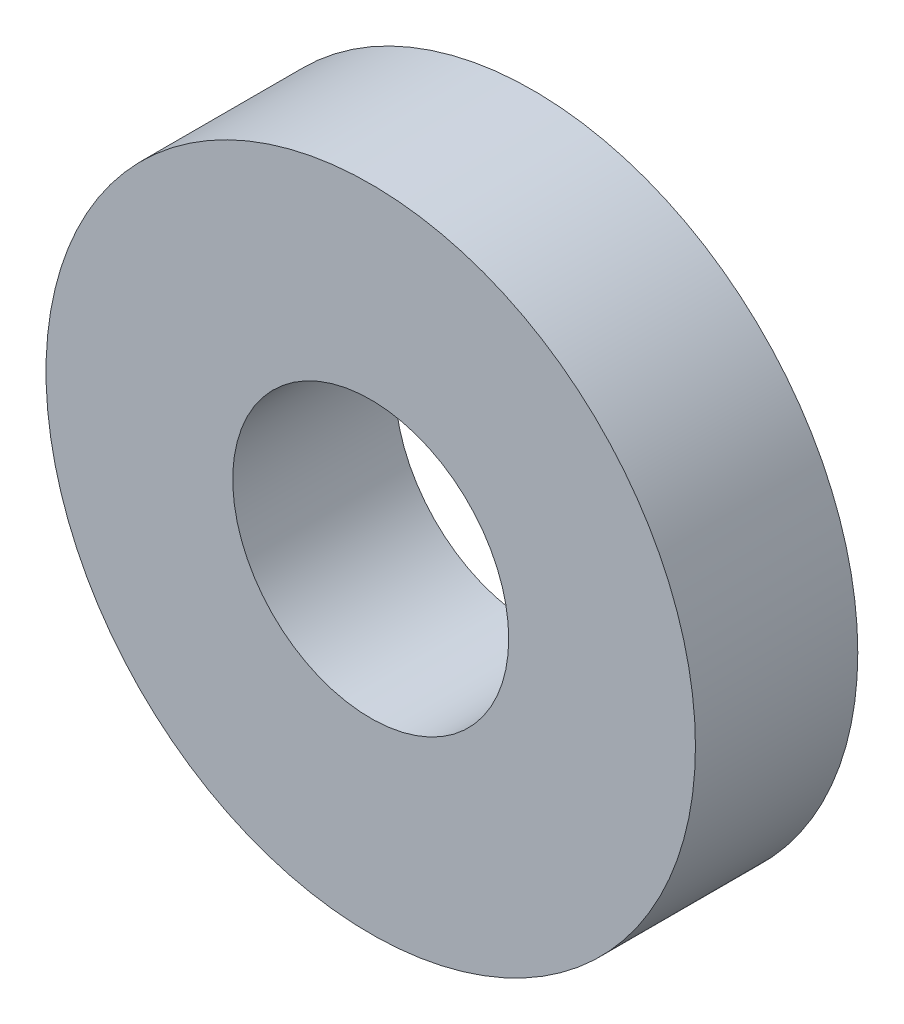
ISO-10303-21;
HEADER;
FILE_DESCRIPTION(('STEP AP214'),'2;1');
FILE_NAME('part.step','',(''),(''),'','','');
FILE_SCHEMA(('AUTOMOTIVE_DESIGN { 1 0 10303 214 1 1 1 1 }'));
ENDSEC;
DATA;
#1=APPLICATION_CONTEXT('core data for automotive mechanical design processes');
#2=APPLICATION_PROTOCOL_DEFINITION('international standard','automotive_design',2000,#1);
#3=PRODUCT_CONTEXT('',#1,'mechanical');
#4=PRODUCT('Part','Part','',(#3));
#5=PRODUCT_RELATED_PRODUCT_CATEGORY('part','',(#4));
#6=PRODUCT_DEFINITION_FORMATION('','',#4);
#7=PRODUCT_DEFINITION_CONTEXT('part definition',#1,'design');
#8=PRODUCT_DEFINITION('design','',#6,#7);
#9=PRODUCT_DEFINITION_SHAPE('','',#8);
#10=(LENGTH_UNIT() NAMED_UNIT(*) SI_UNIT(.MILLI.,.METRE.));
#11=(NAMED_UNIT(*) PLANE_ANGLE_UNIT() SI_UNIT($,.RADIAN.));
#12=(NAMED_UNIT(*) SI_UNIT($,.STERADIAN.) SOLID_ANGLE_UNIT());
#13=UNCERTAINTY_MEASURE_WITH_UNIT(LENGTH_MEASURE(1.E-05),#10,'distance_accuracy_value','');
#14=(GEOMETRIC_REPRESENTATION_CONTEXT(3) GLOBAL_UNCERTAINTY_ASSIGNED_CONTEXT((#13)) GLOBAL_UNIT_ASSIGNED_CONTEXT((#10,
#11,#12)) REPRESENTATION_CONTEXT('',''));
#15=CARTESIAN_POINT('',(0.,0.,0.));
#16=DIRECTION('',(0.,0.,1.));
#17=DIRECTION('',(1.,0.,0.));
#18=AXIS2_PLACEMENT_3D('',#15,#16,#17);
#19=CARTESIAN_POINT('',(0.,0.,-5.));
#20=DIRECTION('',(0.,0.,1.));
#21=DIRECTION('',(1.,0.,0.));
#22=AXIS2_PLACEMENT_3D('',#19,#20,#21);
#23=CYLINDRICAL_SURFACE('',#22,10.);
#24=CARTESIAN_POINT('',(0.,0.,-5.));
#25=DIRECTION('',(0.,0.,1.));
#26=DIRECTION('',(1.,0.,0.));
#27=AXIS2_PLACEMENT_3D('',#24,#25,#26);
#28=CIRCLE('',#27,10.);
#29=CARTESIAN_POINT('',(10.,0.,-5.));
#30=VERTEX_POINT('',#29);
#31=EDGE_CURVE('E10',#30,#30,#28,.T.);
#32=ORIENTED_EDGE('',*,*,#31,.T.);
#33=EDGE_LOOP('',(#32));
#34=FACE_BOUND('',#33,.T.);
#35=CARTESIAN_POINT('',(0.,0.,0.));
#36=DIRECTION('',(0.,0.,1.));
#37=DIRECTION('',(1.,0.,0.));
#38=AXIS2_PLACEMENT_3D('',#35,#36,#37);
#39=CIRCLE('',#38,10.);
#40=CARTESIAN_POINT('',(10.,0.,0.));
#41=VERTEX_POINT('',#40);
#42=EDGE_CURVE('E39',#41,#41,#39,.T.);
#43=ORIENTED_EDGE('',*,*,#42,.F.);
#44=EDGE_LOOP('',(#43));
#45=FACE_BOUND('',#44,.T.);
#46=ADVANCED_FACE('F36',(#34,#45),#23,.T.);
#47=CARTESIAN_POINT('',(0.,0.,-5.));
#48=DIRECTION('',(0.,0.,1.));
#49=DIRECTION('',(1.,0.,0.));
#50=AXIS2_PLACEMENT_3D('',#47,#48,#49);
#51=PLANE('',#50);
#52=CARTESIAN_POINT('',(0.,0.,-5.));
#53=DIRECTION('',(0.,0.,1.));
#54=DIRECTION('',(1.,0.,0.));
#55=AXIS2_PLACEMENT_3D('',#52,#53,#54);
#56=CIRCLE('',#55,4.25);
#57=CARTESIAN_POINT('',(4.25,0.,-5.));
#58=VERTEX_POINT('',#57);
#59=EDGE_CURVE('E46',#58,#58,#56,.T.);
#60=ORIENTED_EDGE('',*,*,#59,.T.);
#61=EDGE_LOOP('',(#60));
#62=FACE_BOUND('',#61,.T.);
#63=ORIENTED_EDGE('',*,*,#31,.F.);
#64=EDGE_LOOP('',(#63));
#65=FACE_BOUND('',#64,.T.);
#66=ADVANCED_FACE('F54',(#62,#65),#51,.F.);
#67=CARTESIAN_POINT('',(0.,0.,0.));
#68=DIRECTION('',(0.,0.,1.));
#69=DIRECTION('',(1.,0.,0.));
#70=AXIS2_PLACEMENT_3D('',#67,#68,#69);
#71=PLANE('',#70);
#72=CARTESIAN_POINT('',(0.,0.,0.));
#73=DIRECTION('',(0.,0.,1.));
#74=DIRECTION('',(1.,0.,0.));
#75=AXIS2_PLACEMENT_3D('',#72,#73,#74);
#76=CIRCLE('',#75,4.25);
#77=CARTESIAN_POINT('',(4.25,0.,0.));
#78=VERTEX_POINT('',#77);
#79=EDGE_CURVE('E48',#78,#78,#76,.T.);
#80=ORIENTED_EDGE('',*,*,#79,.F.);
#81=EDGE_LOOP('',(#80));
#82=FACE_BOUND('',#81,.T.);
#83=ORIENTED_EDGE('',*,*,#42,.T.);
#84=EDGE_LOOP('',(#83));
#85=FACE_BOUND('',#84,.T.);
#86=ADVANCED_FACE('F60',(#82,#85),#71,.T.);
#87=CARTESIAN_POINT('',(0.,0.,-5.));
#88=DIRECTION('',(0.,0.,1.));
#89=DIRECTION('',(1.,0.,0.));
#90=AXIS2_PLACEMENT_3D('',#87,#88,#89);
#91=CYLINDRICAL_SURFACE('',#90,4.25);
#92=ORIENTED_EDGE('',*,*,#59,.F.);
#93=EDGE_LOOP('',(#92));
#94=FACE_BOUND('',#93,.T.);
#95=ORIENTED_EDGE('',*,*,#79,.T.);
#96=EDGE_LOOP('',(#95));
#97=FACE_BOUND('',#96,.T.);
#98=ADVANCED_FACE('F57',(#94,#97),#91,.F.);
#99=CLOSED_SHELL('',(#46,#66,#86,#98));
#100=MANIFOLD_SOLID_BREP('B2',#99);
#101=ADVANCED_BREP_SHAPE_REPRESENTATION('',(#18,#100),#14);
#102=SHAPE_DEFINITION_REPRESENTATION(#9,#101);
ENDSEC;
END-ISO-10303-21;
